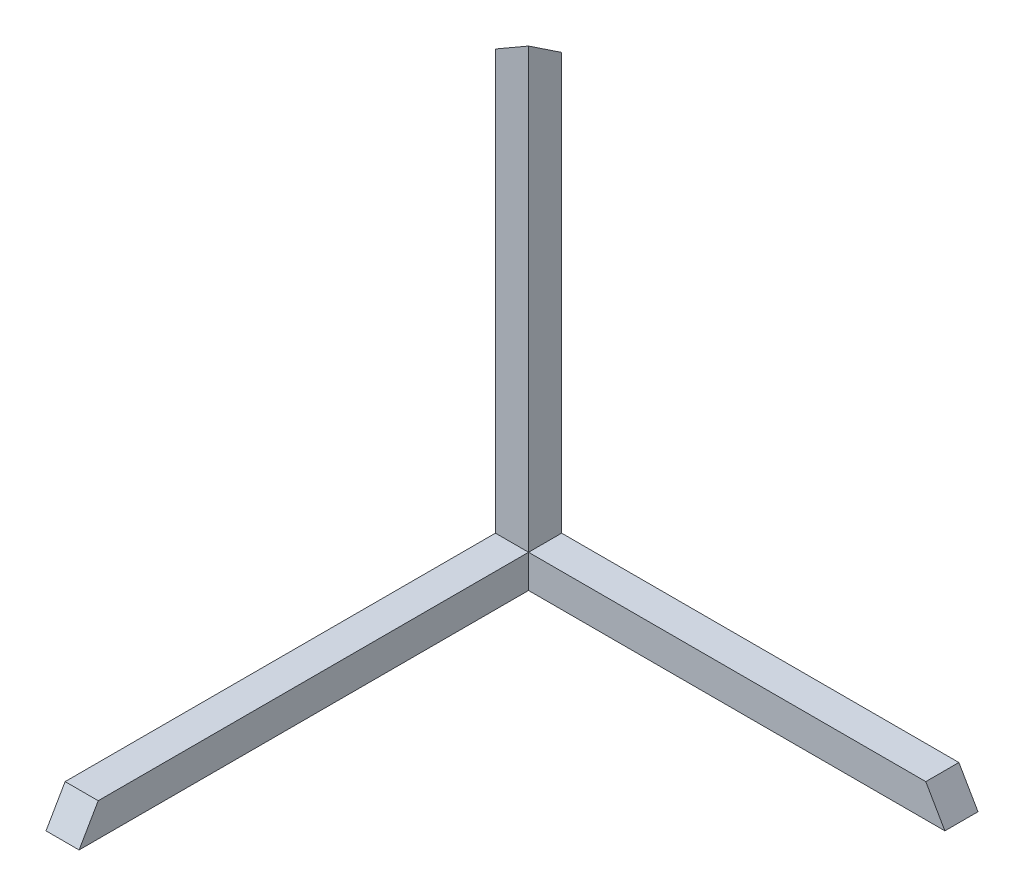
ISO-10303-21;
HEADER;
FILE_DESCRIPTION(('STEP AP214'),'2;1');
FILE_NAME('part.step','',(''),(''),'','','');
FILE_SCHEMA(('AUTOMOTIVE_DESIGN { 1 0 10303 214 1 1 1 1 }'));
ENDSEC;
DATA;
#1=APPLICATION_CONTEXT('core data for automotive mechanical design processes');
#2=APPLICATION_PROTOCOL_DEFINITION('international standard','automotive_design',2000,#1);
#3=PRODUCT_CONTEXT('',#1,'mechanical');
#4=PRODUCT('Part','Part','',(#3));
#5=PRODUCT_RELATED_PRODUCT_CATEGORY('part','',(#4));
#6=PRODUCT_DEFINITION_FORMATION('','',#4);
#7=PRODUCT_DEFINITION_CONTEXT('part definition',#1,'design');
#8=PRODUCT_DEFINITION('design','',#6,#7);
#9=PRODUCT_DEFINITION_SHAPE('','',#8);
#10=(LENGTH_UNIT() NAMED_UNIT(*) SI_UNIT(.MILLI.,.METRE.));
#11=(NAMED_UNIT(*) PLANE_ANGLE_UNIT() SI_UNIT($,.RADIAN.));
#12=(NAMED_UNIT(*) SI_UNIT($,.STERADIAN.) SOLID_ANGLE_UNIT());
#13=UNCERTAINTY_MEASURE_WITH_UNIT(LENGTH_MEASURE(1.E-05),#10,'distance_accuracy_value','');
#14=(GEOMETRIC_REPRESENTATION_CONTEXT(3) GLOBAL_UNCERTAINTY_ASSIGNED_CONTEXT((#13)) GLOBAL_UNIT_ASSIGNED_CONTEXT((#10,
#11,#12)) REPRESENTATION_CONTEXT('',''));
#15=CARTESIAN_POINT('',(0.,0.,0.));
#16=DIRECTION('',(0.,0.,1.));
#17=DIRECTION('',(1.,0.,0.));
#18=AXIS2_PLACEMENT_3D('',#15,#16,#17);
#19=CARTESIAN_POINT('',(-72.5074408291264,22.3679191654526,5.));
#20=DIRECTION('',(-1.,0.,0.));
#21=DIRECTION('',(0.,0.,1.));
#22=AXIS2_PLACEMENT_3D('',#19,#20,#21);
#23=PLANE('',#22);
#24=DIRECTION('',(0.,0.,-1.));
#25=VECTOR('',#24,1.);
#26=CARTESIAN_POINT('',(-72.5074408291264,-42.6320808345474,5.));
#27=LINE('',#26,#25);
#28=CARTESIAN_POINT('',(-72.5074408291264,-42.6320808345474,72.8867513459481));
#29=VERTEX_POINT('',#28);
#30=CARTESIAN_POINT('',(-72.5074408291264,-42.6320808345474,5.));
#31=VERTEX_POINT('',#30);
#32=EDGE_CURVE('E44',#29,#31,#27,.T.);
#33=ORIENTED_EDGE('',*,*,#32,.T.);
#34=DIRECTION('',(0.,1.,0.));
#35=VECTOR('',#34,1.);
#36=CARTESIAN_POINT('',(-72.5074408291264,22.3679191654526,5.));
#37=LINE('',#36,#35);
#38=CARTESIAN_POINT('',(-72.5074408291264,-37.6320808345474,5.));
#39=VERTEX_POINT('',#38);
#40=EDGE_CURVE('E127',#31,#39,#37,.T.);
#41=ORIENTED_EDGE('',*,*,#40,.T.);
#42=DIRECTION('',(0.,0.,1.));
#43=VECTOR('',#42,1.);
#44=CARTESIAN_POINT('',(-72.5074408291264,-37.6320808345474,5.));
#45=LINE('',#44,#43);
#46=CARTESIAN_POINT('',(-72.5074408291264,-37.6320808345474,70.));
#47=VERTEX_POINT('',#46);
#48=EDGE_CURVE('E138',#39,#47,#45,.T.);
#49=ORIENTED_EDGE('',*,*,#48,.T.);
#50=DIRECTION('',(0.,0.866025403784438,-0.500000000000001));
#51=VECTOR('',#50,1.);
#52=CARTESIAN_POINT('',(-72.5074408291264,35.5137447884468,27.7692378864667));
#53=LINE('',#52,#51);
#54=EDGE_CURVE('E140',#29,#47,#53,.T.);
#55=ORIENTED_EDGE('',*,*,#54,.F.);
#56=EDGE_LOOP('',(#33,#41,#49,#55));
#57=FACE_BOUND('',#56,.T.);
#58=ADVANCED_FACE('F34',(#57),#23,.F.);
#59=CARTESIAN_POINT('',(-77.5074408291264,22.3679191654526,5.));
#60=DIRECTION('',(1.,0.,0.));
#61=DIRECTION('',(0.,0.,-1.));
#62=AXIS2_PLACEMENT_3D('',#59,#60,#61);
#63=PLANE('',#62);
#64=DIRECTION('',(0.,-1.,0.));
#65=VECTOR('',#64,1.);
#66=CARTESIAN_POINT('',(-77.5074408291264,22.3679191654526,0.));
#67=LINE('',#66,#65);
#68=CARTESIAN_POINT('',(-77.5074408291264,22.3679191654526,0.));
#69=VERTEX_POINT('',#68);
#70=CARTESIAN_POINT('',(-77.5074408291264,-42.6320808345474,0.));
#71=VERTEX_POINT('',#70);
#72=EDGE_CURVE('E104',#69,#71,#67,.T.);
#73=ORIENTED_EDGE('',*,*,#72,.T.);
#74=DIRECTION('',(0.,0.,-1.));
#75=VECTOR('',#74,1.);
#76=CARTESIAN_POINT('',(-77.5074408291264,-42.6320808345474,5.));
#77=LINE('',#76,#75);
#78=CARTESIAN_POINT('',(-77.5074408291264,-42.6320808345474,72.8867513459481));
#79=VERTEX_POINT('',#78);
#80=EDGE_CURVE('E11',#79,#71,#77,.T.);
#81=ORIENTED_EDGE('',*,*,#80,.F.);
#82=DIRECTION('',(0.,0.866025403784438,-0.500000000000001));
#83=VECTOR('',#82,1.);
#84=CARTESIAN_POINT('',(-77.5074408291264,-37.6320808345474,70.));
#85=LINE('',#84,#83);
#86=CARTESIAN_POINT('',(-77.5074408291264,-37.6320808345474,70.));
#87=VERTEX_POINT('',#86);
#88=EDGE_CURVE('E135',#79,#87,#85,.T.);
#89=ORIENTED_EDGE('',*,*,#88,.T.);
#90=DIRECTION('',(0.,0.,1.));
#91=VECTOR('',#90,1.);
#92=CARTESIAN_POINT('',(-77.5074408291264,-37.6320808345474,5.));
#93=LINE('',#92,#91);
#94=CARTESIAN_POINT('',(-77.5074408291264,-37.6320808345474,5.));
#95=VERTEX_POINT('',#94);
#96=EDGE_CURVE('E139',#95,#87,#93,.T.);
#97=ORIENTED_EDGE('',*,*,#96,.F.);
#98=DIRECTION('',(0.,-1.,0.));
#99=VECTOR('',#98,1.);
#100=CARTESIAN_POINT('',(-77.5074408291264,22.3679191654526,5.));
#101=LINE('',#100,#99);
#102=CARTESIAN_POINT('',(-77.5074408291264,25.7012524987859,5.));
#103=VERTEX_POINT('',#102);
#104=EDGE_CURVE('E98',#103,#95,#101,.T.);
#105=ORIENTED_EDGE('',*,*,#104,.F.);
#106=DIRECTION('',(0.,0.55470019622523,0.832050294337843));
#107=VECTOR('',#106,1.);
#108=CARTESIAN_POINT('',(-77.5074408291264,24.6756114731449,3.46153846153845));
#109=LINE('',#108,#107);
#110=EDGE_CURVE('E38',#103,#69,#109,.F.);
#111=ORIENTED_EDGE('',*,*,#110,.T.);
#112=EDGE_LOOP('',(#73,#81,#89,#97,#105,#111));
#113=FACE_BOUND('',#112,.T.);
#114=ADVANCED_FACE('F103',(#113),#63,.F.);
#115=CARTESIAN_POINT('',(-77.5074408291264,-42.6320808345474,5.));
#116=DIRECTION('',(0.,1.,0.));
#117=DIRECTION('',(0.,0.,1.));
#118=AXIS2_PLACEMENT_3D('',#115,#116,#117);
#119=PLANE('',#118);
#120=ORIENTED_EDGE('',*,*,#80,.T.);
#121=DIRECTION('',(1.,0.,0.));
#122=VECTOR('',#121,1.);
#123=CARTESIAN_POINT('',(-77.5074408291264,-42.6320808345474,0.));
#124=LINE('',#123,#122);
#125=CARTESIAN_POINT('',(-9.62068948317822,-42.6320808345474,0.));
#126=VERTEX_POINT('',#125);
#127=EDGE_CURVE('E111',#71,#126,#124,.T.);
#128=ORIENTED_EDGE('',*,*,#127,.T.);
#129=DIRECTION('',(0.,0.,-1.));
#130=VECTOR('',#129,1.);
#131=CARTESIAN_POINT('',(-9.62068948317822,-42.6320808345474,5.));
#132=LINE('',#131,#130);
#133=CARTESIAN_POINT('',(-9.62068948317822,-42.6320808345474,5.));
#134=VERTEX_POINT('',#133);
#135=EDGE_CURVE('E129',#134,#126,#132,.T.);
#136=ORIENTED_EDGE('',*,*,#135,.F.);
#137=DIRECTION('',(1.,0.,0.));
#138=VECTOR('',#137,1.);
#139=CARTESIAN_POINT('',(-77.5074408291264,-42.6320808345474,5.));
#140=LINE('',#139,#138);
#141=EDGE_CURVE('E132',#31,#134,#140,.T.);
#142=ORIENTED_EDGE('',*,*,#141,.F.);
#143=ORIENTED_EDGE('',*,*,#32,.F.);
#144=DIRECTION('',(-1.,0.,0.));
#145=VECTOR('',#144,1.);
#146=CARTESIAN_POINT('',(-72.5074408291264,-42.6320808345474,72.8867513459481));
#147=LINE('',#146,#145);
#148=EDGE_CURVE('E143',#29,#79,#147,.T.);
#149=ORIENTED_EDGE('',*,*,#148,.T.);
#150=EDGE_LOOP('',(#120,#128,#136,#142,#143,#149));
#151=FACE_BOUND('',#150,.T.);
#152=ADVANCED_FACE('F177',(#151),#119,.F.);
#153=DIRECTION('',(0.,1.,0.));
#154=VECTOR('',#153,1.);
#155=CARTESIAN_POINT('',(-72.5074408291264,22.3679191654526,5.));
#156=LINE('',#155,#154);
#157=CARTESIAN_POINT('',(-72.5074408291264,28.5880038447341,5.));
#158=VERTEX_POINT('',#157);
#159=EDGE_CURVE('E83',#39,#158,#156,.T.);
#160=ORIENTED_EDGE('',*,*,#159,.F.);
#161=DIRECTION('',(0.,0.,-1.));
#162=VECTOR('',#161,1.);
#163=CARTESIAN_POINT('',(-72.5074408291264,-37.6320808345474,5.));
#164=LINE('',#163,#162);
#165=CARTESIAN_POINT('',(-72.5074408291264,-37.6320808345474,0.));
#166=VERTEX_POINT('',#165);
#167=EDGE_CURVE('E152',#39,#166,#164,.T.);
#168=ORIENTED_EDGE('',*,*,#167,.T.);
#169=DIRECTION('',(0.,1.,0.));
#170=VECTOR('',#169,1.);
#171=CARTESIAN_POINT('',(-72.5074408291264,22.3679191654526,0.));
#172=LINE('',#171,#170);
#173=CARTESIAN_POINT('',(-72.5074408291264,25.2546705114007,0.));
#174=VERTEX_POINT('',#173);
#175=EDGE_CURVE('E99',#166,#174,#172,.T.);
#176=ORIENTED_EDGE('',*,*,#175,.T.);
#177=DIRECTION('',(0.,0.55470019622523,0.832050294337843));
#178=VECTOR('',#177,1.);
#179=CARTESIAN_POINT('',(-72.5074408291264,24.366439328032,-1.33234677505299));
#180=LINE('',#179,#178);
#181=EDGE_CURVE('E94',#158,#174,#180,.F.);
#182=ORIENTED_EDGE('',*,*,#181,.F.);
#183=EDGE_LOOP('',(#160,#168,#176,#182));
#184=FACE_BOUND('',#183,.T.);
#185=ADVANCED_FACE('F189',(#184),#23,.F.);
#186=CARTESIAN_POINT('',(-77.5074408291264,22.3679191654526,0.));
#187=DIRECTION('',(-0.43301270189222,0.749999999999999,-0.500000000000001));
#188=DIRECTION('',(0.,0.55470019622523,0.832050294337843));
#189=AXIS2_PLACEMENT_3D('',#186,#187,#188);
#190=PLANE('',#189);
#191=DIRECTION('',(0.866025403784438,0.500000000000001,0.));
#192=VECTOR('',#191,1.);
#193=CARTESIAN_POINT('',(-77.5074408291264,22.3679191654526,0.));
#194=LINE('',#193,#192);
#195=EDGE_CURVE('E90',#174,#69,#194,.F.);
#196=ORIENTED_EDGE('',*,*,#195,.T.);
#197=ORIENTED_EDGE('',*,*,#110,.F.);
#198=DIRECTION('',(0.866025403784438,0.500000000000001,0.));
#199=VECTOR('',#198,1.);
#200=CARTESIAN_POINT('',(-78.9508165021004,24.8679191654526,5.));
#201=LINE('',#200,#199);
#202=EDGE_CURVE('E108',#158,#103,#201,.F.);
#203=ORIENTED_EDGE('',*,*,#202,.F.);
#204=ORIENTED_EDGE('',*,*,#181,.T.);
#205=EDGE_LOOP('',(#196,#197,#203,#204));
#206=FACE_BOUND('',#205,.T.);
#207=ADVANCED_FACE('F36',(#206),#190,.T.);
#208=CARTESIAN_POINT('',(0.,0.,5.));
#209=DIRECTION('',(0.,0.,1.));
#210=DIRECTION('',(1.,0.,0.));
#211=AXIS2_PLACEMENT_3D('',#208,#209,#210);
#212=PLANE('',#211);
#213=DIRECTION('',(-1.,0.,0.));
#214=VECTOR('',#213,1.);
#215=CARTESIAN_POINT('',(-72.5074408291264,-37.6320808345474,5.));
#216=LINE('',#215,#214);
#217=EDGE_CURVE('E112',#39,#95,#216,.T.);
#218=ORIENTED_EDGE('',*,*,#217,.F.);
#219=ORIENTED_EDGE('',*,*,#159,.T.);
#220=ORIENTED_EDGE('',*,*,#202,.T.);
#221=ORIENTED_EDGE('',*,*,#104,.T.);
#222=EDGE_LOOP('',(#218,#219,#220,#221));
#223=FACE_BOUND('',#222,.T.);
#224=ADVANCED_FACE('F186',(#223),#212,.T.);
#225=CARTESIAN_POINT('',(0.,0.,0.));
#226=DIRECTION('',(0.,0.,1.));
#227=DIRECTION('',(1.,0.,0.));
#228=AXIS2_PLACEMENT_3D('',#225,#226,#227);
#229=PLANE('',#228);
#230=ORIENTED_EDGE('',*,*,#175,.F.);
#231=DIRECTION('',(-1.,0.,0.));
#232=VECTOR('',#231,1.);
#233=CARTESIAN_POINT('',(-77.5074408291264,-37.6320808345474,0.));
#234=LINE('',#233,#232);
#235=CARTESIAN_POINT('',(-12.5074408291264,-37.6320808345474,0.));
#236=VERTEX_POINT('',#235);
#237=EDGE_CURVE('E52',#236,#166,#234,.T.);
#238=ORIENTED_EDGE('',*,*,#237,.F.);
#239=DIRECTION('',(-0.500000000000001,0.866025403784438,0.));
#240=VECTOR('',#239,1.);
#241=CARTESIAN_POINT('',(-25.6757496218386,-14.823900955814,0.));
#242=LINE('',#241,#240);
#243=EDGE_CURVE('E124',#126,#236,#242,.T.);
#244=ORIENTED_EDGE('',*,*,#243,.F.);
#245=ORIENTED_EDGE('',*,*,#127,.F.);
#246=ORIENTED_EDGE('',*,*,#72,.F.);
#247=ORIENTED_EDGE('',*,*,#195,.F.);
#248=EDGE_LOOP('',(#230,#238,#244,#245,#246,#247));
#249=FACE_BOUND('',#248,.T.);
#250=ADVANCED_FACE('F109',(#249),#229,.F.);
#251=CARTESIAN_POINT('',(-72.5074408291264,-37.6320808345474,5.));
#252=DIRECTION('',(0.,-1.,0.));
#253=DIRECTION('',(0.,0.,-1.));
#254=AXIS2_PLACEMENT_3D('',#251,#252,#253);
#255=PLANE('',#254);
#256=ORIENTED_EDGE('',*,*,#96,.T.);
#257=DIRECTION('',(-1.,0.,0.));
#258=VECTOR('',#257,1.);
#259=CARTESIAN_POINT('',(-72.5074408291264,-37.6320808345474,70.));
#260=LINE('',#259,#258);
#261=EDGE_CURVE('E116',#47,#87,#260,.T.);
#262=ORIENTED_EDGE('',*,*,#261,.F.);
#263=ORIENTED_EDGE('',*,*,#48,.F.);
#264=ORIENTED_EDGE('',*,*,#217,.T.);
#265=EDGE_LOOP('',(#256,#262,#263,#264));
#266=FACE_BOUND('',#265,.T.);
#267=ADVANCED_FACE('F190',(#266),#255,.F.);
#268=CARTESIAN_POINT('',(-72.5074408291264,-37.6320808345474,70.));
#269=DIRECTION('',(0.,0.500000000000001,0.866025403784438));
#270=DIRECTION('',(0.,-0.866025403784438,0.500000000000001));
#271=AXIS2_PLACEMENT_3D('',#268,#269,#270);
#272=PLANE('',#271);
#273=ORIENTED_EDGE('',*,*,#88,.F.);
#274=ORIENTED_EDGE('',*,*,#148,.F.);
#275=ORIENTED_EDGE('',*,*,#54,.T.);
#276=ORIENTED_EDGE('',*,*,#261,.T.);
#277=EDGE_LOOP('',(#273,#274,#275,#276));
#278=FACE_BOUND('',#277,.T.);
#279=ADVANCED_FACE('F195',(#278),#272,.T.);
#280=CARTESIAN_POINT('',(0.,-37.6320808345474,0.));
#281=DIRECTION('',(0.,1.,0.));
#282=DIRECTION('',(0.,0.,1.));
#283=AXIS2_PLACEMENT_3D('',#280,#281,#282);
#284=PLANE('',#283);
#285=ORIENTED_EDGE('',*,*,#167,.F.);
#286=DIRECTION('',(1.,0.,0.));
#287=VECTOR('',#286,1.);
#288=CARTESIAN_POINT('',(-77.5074408291264,-37.6320808345474,5.));
#289=LINE('',#288,#287);
#290=CARTESIAN_POINT('',(-12.5074408291264,-37.6320808345474,5.));
#291=VERTEX_POINT('',#290);
#292=EDGE_CURVE('E161',#39,#291,#289,.T.);
#293=ORIENTED_EDGE('',*,*,#292,.T.);
#294=DIRECTION('',(0.,0.,-1.));
#295=VECTOR('',#294,1.);
#296=CARTESIAN_POINT('',(-12.5074408291264,-37.6320808345474,0.));
#297=LINE('',#296,#295);
#298=EDGE_CURVE('E159',#291,#236,#297,.T.);
#299=ORIENTED_EDGE('',*,*,#298,.T.);
#300=ORIENTED_EDGE('',*,*,#237,.T.);
#301=EDGE_LOOP('',(#285,#293,#299,#300));
#302=FACE_BOUND('',#301,.T.);
#303=ADVANCED_FACE('F179',(#302),#284,.T.);
#304=CARTESIAN_POINT('',(-77.5074408291264,-42.6320808345474,5.));
#305=DIRECTION('',(0.,0.,1.));
#306=DIRECTION('',(1.,0.,0.));
#307=AXIS2_PLACEMENT_3D('',#304,#305,#306);
#308=PLANE('',#307);
#309=ORIENTED_EDGE('',*,*,#40,.F.);
#310=ORIENTED_EDGE('',*,*,#141,.T.);
#311=DIRECTION('',(-0.500000000000001,0.866025403784438,0.));
#312=VECTOR('',#311,1.);
#313=CARTESIAN_POINT('',(-26.5923773196653,-13.2362552115531,5.));
#314=LINE('',#313,#312);
#315=EDGE_CURVE('E128',#134,#291,#314,.T.);
#316=ORIENTED_EDGE('',*,*,#315,.T.);
#317=ORIENTED_EDGE('',*,*,#292,.F.);
#318=EDGE_LOOP('',(#309,#310,#316,#317));
#319=FACE_BOUND('',#318,.T.);
#320=ADVANCED_FACE('F168',(#319),#308,.T.);
#321=CARTESIAN_POINT('',(-12.5074408291264,-37.6320808345474,0.));
#322=DIRECTION('',(0.866025403784438,0.500000000000001,0.));
#323=DIRECTION('',(-0.500000000000001,0.866025403784438,0.));
#324=AXIS2_PLACEMENT_3D('',#321,#322,#323);
#325=PLANE('',#324);
#326=ORIENTED_EDGE('',*,*,#298,.F.);
#327=ORIENTED_EDGE('',*,*,#315,.F.);
#328=ORIENTED_EDGE('',*,*,#135,.T.);
#329=ORIENTED_EDGE('',*,*,#243,.T.);
#330=EDGE_LOOP('',(#326,#327,#328,#329));
#331=FACE_BOUND('',#330,.T.);
#332=ADVANCED_FACE('F176',(#331),#325,.T.);
#333=CLOSED_SHELL('',(#58,#114,#152,#185,#207,#224,#250,#267,#279,#303,#320,#332));
#334=MANIFOLD_SOLID_BREP('B2',#333);
#335=ADVANCED_BREP_SHAPE_REPRESENTATION('',(#18,#334),#14);
#336=SHAPE_DEFINITION_REPRESENTATION(#9,#335);
ENDSEC;
END-ISO-10303-21;
